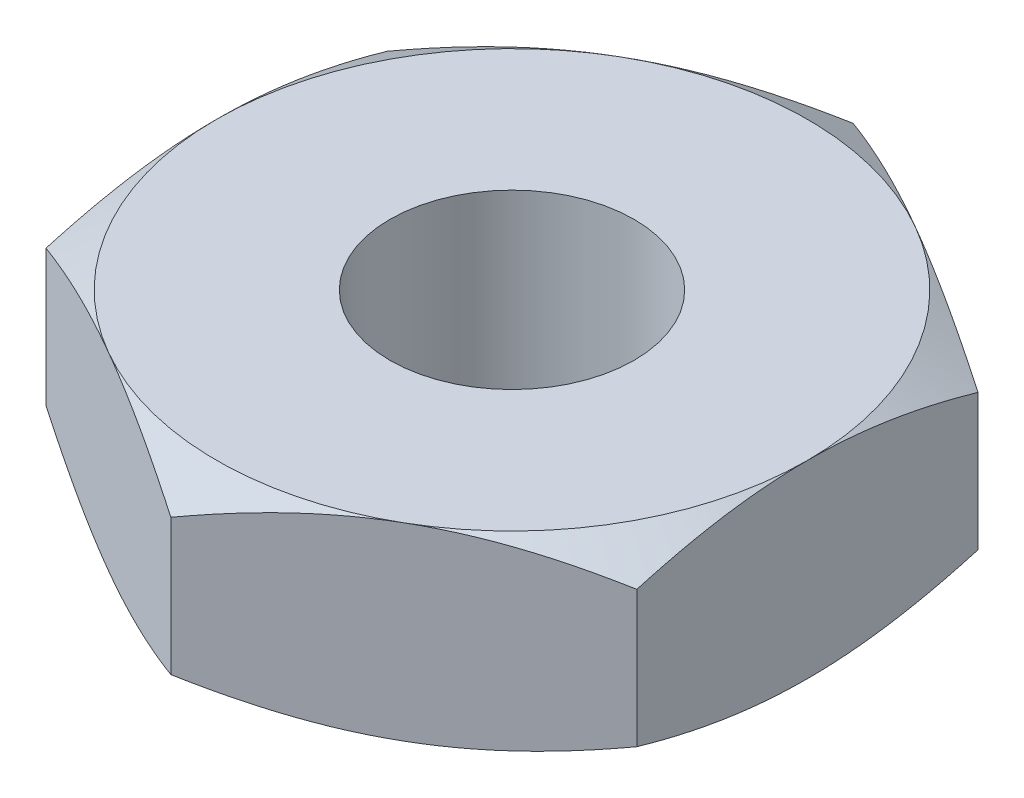
ISO-10303-21;
HEADER;
FILE_DESCRIPTION(('STEP AP214'),'2;1');
FILE_NAME('part.step','',(''),(''),'','','');
FILE_SCHEMA(('AUTOMOTIVE_DESIGN { 1 0 10303 214 1 1 1 1 }'));
ENDSEC;
DATA;
#1=APPLICATION_CONTEXT('core data for automotive mechanical design processes');
#2=APPLICATION_PROTOCOL_DEFINITION('international standard','automotive_design',2000,#1);
#3=PRODUCT_CONTEXT('',#1,'mechanical');
#4=PRODUCT('Part','Part','',(#3));
#5=PRODUCT_RELATED_PRODUCT_CATEGORY('part','',(#4));
#6=PRODUCT_DEFINITION_FORMATION('','',#4);
#7=PRODUCT_DEFINITION_CONTEXT('part definition',#1,'design');
#8=PRODUCT_DEFINITION('design','',#6,#7);
#9=PRODUCT_DEFINITION_SHAPE('','',#8);
#10=(LENGTH_UNIT() NAMED_UNIT(*) SI_UNIT(.MILLI.,.METRE.));
#11=(NAMED_UNIT(*) PLANE_ANGLE_UNIT() SI_UNIT($,.RADIAN.));
#12=(NAMED_UNIT(*) SI_UNIT($,.STERADIAN.) SOLID_ANGLE_UNIT());
#13=UNCERTAINTY_MEASURE_WITH_UNIT(LENGTH_MEASURE(1.E-05),#10,'distance_accuracy_value','');
#14=(GEOMETRIC_REPRESENTATION_CONTEXT(3) GLOBAL_UNCERTAINTY_ASSIGNED_CONTEXT((#13)) GLOBAL_UNIT_ASSIGNED_CONTEXT((#10,
#11,#12)) REPRESENTATION_CONTEXT('',''));
#15=CARTESIAN_POINT('',(0.,0.,0.));
#16=DIRECTION('',(0.,0.,1.));
#17=DIRECTION('',(1.,0.,0.));
#18=AXIS2_PLACEMENT_3D('',#15,#16,#17);
#19=CARTESIAN_POINT('',(2.5,1.6,-1.44337567297406));
#20=DIRECTION('',(-0.5,0.,0.866025403784439));
#21=DIRECTION('',(0.866025403784439,0.,0.5));
#22=AXIS2_PLACEMENT_3D('',#19,#20,#21);
#23=PLANE('',#22);
#24=DIRECTION('',(0.,-1.,0.));
#25=VECTOR('',#24,1.);
#26=CARTESIAN_POINT('',(2.5,1.6,-1.44337567297406));
#27=LINE('',#26,#25);
#28=CARTESIAN_POINT('',(2.5,1.3767090063074,-1.44337567297406));
#29=VERTEX_POINT('',#28);
#30=CARTESIAN_POINT('',(2.5,0.223290993692599,-1.44337567297406));
#31=VERTEX_POINT('',#30);
#32=EDGE_CURVE('E158',#29,#31,#27,.T.);
#33=ORIENTED_EDGE('',*,*,#32,.T.);
#34=CARTESIAN_POINT('',(2.5002,0.223357664359106,-1.44326020292023));
#35=CARTESIAN_POINT('',(2.39033676526513,0.186721620107623,-1.50668977106845));
#36=CARTESIAN_POINT('',(2.27952520010347,0.153402218965054,-1.57066685804385));
#37=CARTESIAN_POINT('',(2.05598316653395,0.0952422855578563,-1.69972891130041));
#38=CARTESIAN_POINT('',(1.94324872547161,0.0704223291477371,-1.7648161711947));
#39=CARTESIAN_POINT('',(1.71917700612473,0.0317856514410512,-1.8941840386774));
#40=CARTESIAN_POINT('',(1.60787420823262,0.0177117961856382,-1.95844473900197));
#41=CARTESIAN_POINT('',(1.38474477253167,0.00090915235274961,-2.08726857876804));
#42=CARTESIAN_POINT('',(1.27291894598577,-0.00183354879637404,-2.15183124982667));
#43=CARTESIAN_POINT('',(1.06395802444848,0.00386576000805273,-2.27247489412633));
#44=CARTESIAN_POINT('',(0.96679168244227,0.0109083943818608,-2.32857390783979));
#45=CARTESIAN_POINT('',(0.773092050288998,0.0332314191249413,-2.44040644260541));
#46=CARTESIAN_POINT('',(0.676559430340268,0.0485194384402656,-2.49613957671839));
#47=CARTESIAN_POINT('',(0.482460278259524,0.0867390938444183,-2.60820277442169));
#48=CARTESIAN_POINT('',(0.38491831821786,0.109832776125515,-2.66451865130903));
#49=CARTESIAN_POINT('',(0.191289391923915,0.162246656577911,-2.77631036402774));
#50=CARTESIAN_POINT('',(0.0951999441138243,0.191554535624546,-2.83178763258717));
#51=CARTESIAN_POINT('',(-0.000200000000000095,0.223357664359105,-2.88686681600197));
#52=B_SPLINE_CURVE_WITH_KNOTS('',3,(#34,#35,#36,#37,#38,#39,#40,#41,#42,#43,#44,#45,#46,#47,#48,
#49,#50,#51),.UNSPECIFIED.,.F.,.F.,(4,2,2,2,2,2,2,2,4),(0.,0.396285827362226,0.793524330152049,
1.18093086852114,1.56786160134475,1.90479741793733,2.24204551660463,2.58677531536756,
2.93082800105256),.UNSPECIFIED.);
#53=CARTESIAN_POINT('',(1.25,0.,-2.1650635094611));
#54=VERTEX_POINT('',#53);
#55=EDGE_CURVE('E64',#31,#54,#52,.T.);
#56=ORIENTED_EDGE('',*,*,#55,.T.);
#57=CARTESIAN_POINT('',(0.,0.223290993692599,-2.88675134594813));
#58=VERTEX_POINT('',#57);
#59=EDGE_CURVE('E131',#54,#58,#52,.T.);
#60=ORIENTED_EDGE('',*,*,#59,.T.);
#61=DIRECTION('',(0.,-1.,0.));
#62=VECTOR('',#61,1.);
#63=CARTESIAN_POINT('',(0.,1.6,-2.88675134594813));
#64=LINE('',#63,#62);
#65=CARTESIAN_POINT('',(0.,1.3767090063074,-2.88675134594813));
#66=VERTEX_POINT('',#65);
#67=EDGE_CURVE('E258',#66,#58,#64,.T.);
#68=ORIENTED_EDGE('',*,*,#67,.F.);
#69=CARTESIAN_POINT('',(-0.000200000000000084,1.37664233564089,-2.88686681600197));
#70=CARTESIAN_POINT('',(0.109663234734871,1.41327837989238,-2.82343724785374));
#71=CARTESIAN_POINT('',(0.220474799896525,1.44659778103495,-2.75946016087834));
#72=CARTESIAN_POINT('',(0.444016833466049,1.50475771444214,-2.63039810762178));
#73=CARTESIAN_POINT('',(0.556751274528388,1.52957767085226,-2.5653108477275));
#74=CARTESIAN_POINT('',(0.780822993875268,1.56821434855895,-2.43594298024479));
#75=CARTESIAN_POINT('',(0.892125791767376,1.58228820381436,-2.37168227992023));
#76=CARTESIAN_POINT('',(1.11525522746833,1.59909084764725,-2.24285844015415));
#77=CARTESIAN_POINT('',(1.22708105401423,1.60183354879637,-2.17829576909552));
#78=CARTESIAN_POINT('',(1.43604197555152,1.59613423999195,-2.05765212479586));
#79=CARTESIAN_POINT('',(1.53320831755773,1.58909160561814,-2.0015531110824));
#80=CARTESIAN_POINT('',(1.726907949711,1.56676858087506,-1.88972057631678));
#81=CARTESIAN_POINT('',(1.82344056965973,1.55148056155973,-1.8339874422038));
#82=CARTESIAN_POINT('',(2.01753972174048,1.51326090615558,-1.7219242445005));
#83=CARTESIAN_POINT('',(2.11508168178214,1.49016722387449,-1.66560836761316));
#84=CARTESIAN_POINT('',(2.30871060807608,1.43775334342209,-1.55381665489446));
#85=CARTESIAN_POINT('',(2.40480005588618,1.40844546437545,-1.49833938633502));
#86=CARTESIAN_POINT('',(2.5002,1.3766423356409,-1.44326020292023));
#87=B_SPLINE_CURVE_WITH_KNOTS('',3,(#69,#70,#71,#72,#73,#74,#75,#76,#77,#78,#79,#80,#81,#82,#83,
#84,#85,#86),.UNSPECIFIED.,.F.,.F.,(4,2,2,2,2,2,2,2,4),(0.,0.396285827362226,0.79352433015205,
1.18093086852114,1.56786160134475,1.90479741793733,2.24204551660463,2.58677531536756,
2.93082800105256),.UNSPECIFIED.);
#88=CARTESIAN_POINT('',(1.25,1.6,-2.1650635094611));
#89=VERTEX_POINT('',#88);
#90=EDGE_CURVE('E296',#66,#89,#87,.T.);
#91=ORIENTED_EDGE('',*,*,#90,.T.);
#92=EDGE_CURVE('E302',#89,#29,#87,.T.);
#93=ORIENTED_EDGE('',*,*,#92,.T.);
#94=EDGE_LOOP('',(#33,#56,#60,#68,#91,#93));
#95=FACE_BOUND('',#94,.T.);
#96=ADVANCED_FACE('F41',(#95),#23,.F.);
#97=CARTESIAN_POINT('',(0.,1.6,-2.88675134594813));
#98=DIRECTION('',(0.5,0.,0.866025403784439));
#99=DIRECTION('',(0.866025403784439,0.,-0.5));
#100=AXIS2_PLACEMENT_3D('',#97,#98,#99);
#101=PLANE('',#100);
#102=ORIENTED_EDGE('',*,*,#67,.T.);
#103=CARTESIAN_POINT('',(0.000199999999999964,0.223357664359105,-2.88686681600197));
#104=CARTESIAN_POINT('',(-0.109663234734871,0.186721620107623,-2.82343724785375));
#105=CARTESIAN_POINT('',(-0.220474799896526,0.153402218965054,-2.75946016087834));
#106=CARTESIAN_POINT('',(-0.444016833466049,0.0952422855578562,-2.63039810762178));
#107=CARTESIAN_POINT('',(-0.556751274528387,0.0704223291477371,-2.5653108477275));
#108=CARTESIAN_POINT('',(-0.780822993875268,0.0317856514410512,-2.43594298024479));
#109=CARTESIAN_POINT('',(-0.892125791767376,0.0177117961856381,-2.37168227992023));
#110=CARTESIAN_POINT('',(-1.11525522746833,0.000909152352749529,-2.24285844015415));
#111=CARTESIAN_POINT('',(-1.22708105401422,-0.00183354879637401,-2.17829576909553));
#112=CARTESIAN_POINT('',(-1.43604197555152,0.00386576000805285,-2.05765212479586));
#113=CARTESIAN_POINT('',(-1.53320831755773,0.0109083943818609,-2.0015531110824));
#114=CARTESIAN_POINT('',(-1.726907949711,0.0332314191249415,-1.88972057631678));
#115=CARTESIAN_POINT('',(-1.82344056965973,0.048519438440266,-1.8339874422038));
#116=CARTESIAN_POINT('',(-2.01753972174048,0.0867390938444188,-1.7219242445005));
#117=CARTESIAN_POINT('',(-2.11508168178214,0.109832776125515,-1.66560836761316));
#118=CARTESIAN_POINT('',(-2.30871060807609,0.162246656577911,-1.55381665489446));
#119=CARTESIAN_POINT('',(-2.40480005588618,0.191554535624546,-1.49833938633502));
#120=CARTESIAN_POINT('',(-2.5002,0.223357664359106,-1.44326020292023));
#121=B_SPLINE_CURVE_WITH_KNOTS('',3,(#103,#104,#105,#106,#107,#108,#109,#110,#111,#112,#113,
#114,#115,#116,#117,#118,#119,#120),.UNSPECIFIED.,.F.,.F.,(4,2,2,2,2,2,2,2,4),(0.,
0.396285827362226,0.793524330152049,1.18093086852114,1.56786160134475,1.90479741793733,
2.24204551660463,2.58677531536756,2.93082800105256),.UNSPECIFIED.);
#122=CARTESIAN_POINT('',(-1.25,0.,-2.1650635094611));
#123=VERTEX_POINT('',#122);
#124=EDGE_CURVE('E137',#58,#123,#121,.T.);
#125=ORIENTED_EDGE('',*,*,#124,.T.);
#126=CARTESIAN_POINT('',(-2.5,0.223290993692599,-1.44337567297406));
#127=VERTEX_POINT('',#126);
#128=EDGE_CURVE('E169',#123,#127,#121,.T.);
#129=ORIENTED_EDGE('',*,*,#128,.T.);
#130=DIRECTION('',(0.,-1.,0.));
#131=VECTOR('',#130,1.);
#132=CARTESIAN_POINT('',(-2.5,1.6,-1.44337567297406));
#133=LINE('',#132,#131);
#134=CARTESIAN_POINT('',(-2.5,1.3767090063074,-1.44337567297406));
#135=VERTEX_POINT('',#134);
#136=EDGE_CURVE('E255',#135,#127,#133,.T.);
#137=ORIENTED_EDGE('',*,*,#136,.F.);
#138=CARTESIAN_POINT('',(-2.5002,1.37664233564089,-1.44326020292023));
#139=CARTESIAN_POINT('',(-2.39033676526513,1.41327837989238,-1.50668977106845));
#140=CARTESIAN_POINT('',(-2.27952520010348,1.44659778103495,-1.57066685804385));
#141=CARTESIAN_POINT('',(-2.05598316653395,1.50475771444214,-1.69972891130041));
#142=CARTESIAN_POINT('',(-1.94324872547161,1.52957767085226,-1.7648161711947));
#143=CARTESIAN_POINT('',(-1.71917700612473,1.56821434855895,-1.8941840386774));
#144=CARTESIAN_POINT('',(-1.60787420823262,1.58228820381436,-1.95844473900197));
#145=CARTESIAN_POINT('',(-1.38474477253167,1.59909084764725,-2.08726857876804));
#146=CARTESIAN_POINT('',(-1.27291894598578,1.60183354879637,-2.15183124982667));
#147=CARTESIAN_POINT('',(-1.06395802444848,1.59613423999195,-2.27247489412633));
#148=CARTESIAN_POINT('',(-0.966791682442271,1.58909160561814,-2.32857390783979));
#149=CARTESIAN_POINT('',(-0.773092050288999,1.56676858087506,-2.44040644260541));
#150=CARTESIAN_POINT('',(-0.676559430340269,1.55148056155973,-2.49613957671839));
#151=CARTESIAN_POINT('',(-0.482460278259525,1.51326090615558,-2.60820277442169));
#152=CARTESIAN_POINT('',(-0.38491831821786,1.49016722387449,-2.66451865130903));
#153=CARTESIAN_POINT('',(-0.191289391923915,1.43775334342209,-2.77631036402774));
#154=CARTESIAN_POINT('',(-0.0951999441138242,1.40844546437545,-2.83178763258717));
#155=CARTESIAN_POINT('',(0.000200000000000055,1.37664233564089,-2.88686681600197));
#156=B_SPLINE_CURVE_WITH_KNOTS('',3,(#138,#139,#140,#141,#142,#143,#144,#145,#146,#147,#148,
#149,#150,#151,#152,#153,#154,#155),.UNSPECIFIED.,.F.,.F.,(4,2,2,2,2,2,2,2,4),(0.,
0.396285827362226,0.793524330152049,1.18093086852114,1.56786160134475,1.90479741793733,
2.24204551660463,2.58677531536756,2.93082800105256),.UNSPECIFIED.);
#157=CARTESIAN_POINT('',(-1.25,1.6,-2.1650635094611));
#158=VERTEX_POINT('',#157);
#159=EDGE_CURVE('E351',#135,#158,#156,.T.);
#160=ORIENTED_EDGE('',*,*,#159,.T.);
#161=EDGE_CURVE('E239',#158,#66,#156,.T.);
#162=ORIENTED_EDGE('',*,*,#161,.T.);
#163=EDGE_LOOP('',(#102,#125,#129,#137,#160,#162));
#164=FACE_BOUND('',#163,.T.);
#165=ADVANCED_FACE('F223',(#164),#101,.F.);
#166=CARTESIAN_POINT('',(-2.5,1.6,-1.44337567297406));
#167=DIRECTION('',(1.,0.,0.));
#168=DIRECTION('',(0.,0.,-1.));
#169=AXIS2_PLACEMENT_3D('',#166,#167,#168);
#170=PLANE('',#169);
#171=ORIENTED_EDGE('',*,*,#136,.T.);
#172=CARTESIAN_POINT('',(-2.5,1.19631676327538,-3.82804499372432));
#173=CARTESIAN_POINT('',(-2.5,1.14327266922929,-3.71828085649172));
#174=CARTESIAN_POINT('',(-2.5,1.09075587737961,-3.60825720059553));
#175=CARTESIAN_POINT('',(-2.5,0.987078216748211,-3.38755052986221));
#176=CARTESIAN_POINT('',(-2.5,0.935917582729504,-3.27686740487454));
#177=CARTESIAN_POINT('',(-2.5,0.834984039411584,-3.05410357303958));
#178=CARTESIAN_POINT('',(-2.5,0.785220746914385,-2.94201849305851));
#179=CARTESIAN_POINT('',(-2.5,0.687831615887674,-2.71692709217039));
#180=CARTESIAN_POINT('',(-2.5,0.640205665942501,-2.6039208196471));
#181=CARTESIAN_POINT('',(-2.5,0.547094156496466,-2.3754044171561));
#182=CARTESIAN_POINT('',(-2.5,0.501642052634894,-2.25988058014231));
#183=CARTESIAN_POINT('',(-2.5,0.41429764434963,-2.02747029246855));
#184=CARTESIAN_POINT('',(-2.5,0.372405735979058,-1.91058369184875));
#185=CARTESIAN_POINT('',(-2.5,0.293307342769295,-1.67550198908606));
#186=CARTESIAN_POINT('',(-2.5,0.256090896739893,-1.5573102732053));
#187=CARTESIAN_POINT('',(-2.5,0.187552097840313,-1.31924659147407));
#188=CARTESIAN_POINT('',(-2.5,0.156227881047967,-1.19937516991093));
#189=CARTESIAN_POINT('',(-2.5,0.100994246846274,-0.957870204363746));
#190=CARTESIAN_POINT('',(-2.5,0.0770868037228361,-0.836236200197807));
#191=CARTESIAN_POINT('',(-2.5,0.038296397451464,-0.591501703670344));
#192=CARTESIAN_POINT('',(-2.5,0.0234134422823116,-0.468401210012356));
#193=CARTESIAN_POINT('',(-2.5,0.00398863321839781,-0.222157493517462));
#194=CARTESIAN_POINT('',(-2.5,-0.000618687975650645,-0.0990195694337553));
#195=CARTESIAN_POINT('',(-2.5,0.00075254148424759,0.147170053504669));
#196=CARTESIAN_POINT('',(-2.5,0.00672834425959459,0.270221766445129));
#197=CARTESIAN_POINT('',(-2.5,0.0255492091334945,0.48035039701595));
#198=CARTESIAN_POINT('',(-2.5,0.035943310027444,0.567659136488641));
#199=CARTESIAN_POINT('',(-2.5,0.061383381466683,0.741602181646865));
#200=CARTESIAN_POINT('',(-2.5,0.0764300856615298,0.828236378756341));
#201=CARTESIAN_POINT('',(-2.5,0.127759419343896,1.08705653408107));
#202=CARTESIAN_POINT('',(-2.5,0.170218054015723,1.25802931580453));
#203=CARTESIAN_POINT('',(-2.5,0.243447724573256,1.5138640813408));
#204=CARTESIAN_POINT('',(-2.5,0.269821213632277,1.60005960225964));
#205=CARTESIAN_POINT('',(-2.5,0.325177862642356,1.7715509943838));
#206=CARTESIAN_POINT('',(-2.5,0.354159222616826,1.85684744139726));
#207=CARTESIAN_POINT('',(-2.5,0.414128561987685,2.02618400322716));
#208=CARTESIAN_POINT('',(-2.5,0.445104328595944,2.11022848716777));
#209=CARTESIAN_POINT('',(-2.5,0.508873971119196,2.27766538220575));
#210=CARTESIAN_POINT('',(-2.5,0.541668581852114,2.36105751399621));
#211=CARTESIAN_POINT('',(-2.5,0.575193129088629,2.44414811866682));
#212=B_SPLINE_CURVE_WITH_KNOTS('',3,(#172,#173,#174,#175,#176,#177,#178,#179,#180,#181,#182,
#183,#184,#185,#186,#187,#188,#189,#190,#191,#192,#193,#194,#195,#196,#197,#198,#199,#200,#201,
#202,#203,#204,#205,#206,#207,#208,#209,#210,#211),.UNSPECIFIED.,.F.,.F.,(4,2,2,2,2,2,2,2,2,2,2,
2,2,2,2,2,2,2,2,4),(0.,0.365732370332669,0.731527644124541,1.09941621653743,1.46728558928017,
1.83967125623427,2.2120982950668,2.58371790436,2.95521975869669,3.32682041917402,
3.69842140819257,4.06764803658772,4.43677881037428,4.7004258801595,4.96411454456775,
5.49188432099895,5.76228301186057,6.03249648197688,6.30118900914359,6.56999089095296),.UNSPECIFIED.);
#213=CARTESIAN_POINT('',(-2.5,0.,0.));
#214=VERTEX_POINT('',#213);
#215=EDGE_CURVE('E217',#127,#214,#212,.T.);
#216=ORIENTED_EDGE('',*,*,#215,.T.);
#217=CARTESIAN_POINT('',(-2.5,0.223290993692599,1.44337567297407));
#218=VERTEX_POINT('',#217);
#219=EDGE_CURVE('E210',#214,#218,#212,.T.);
#220=ORIENTED_EDGE('',*,*,#219,.T.);
#221=DIRECTION('',(0.,-1.,0.));
#222=VECTOR('',#221,1.);
#223=CARTESIAN_POINT('',(-2.5,1.6,1.44337567297407));
#224=LINE('',#223,#222);
#225=CARTESIAN_POINT('',(-2.5,1.3767090063074,1.44337567297407));
#226=VERTEX_POINT('',#225);
#227=EDGE_CURVE('E252',#226,#218,#224,.T.);
#228=ORIENTED_EDGE('',*,*,#227,.F.);
#229=CARTESIAN_POINT('',(-2.5,0.40368323672462,-3.82804499372432));
#230=CARTESIAN_POINT('',(-2.5,0.456727330770707,-3.71828085649172));
#231=CARTESIAN_POINT('',(-2.5,0.509244122620395,-3.60825720059553));
#232=CARTESIAN_POINT('',(-2.5,0.61292178325179,-3.38755052986221));
#233=CARTESIAN_POINT('',(-2.5,0.664082417270497,-3.27686740487454));
#234=CARTESIAN_POINT('',(-2.5,0.765015960588417,-3.05410357303958));
#235=CARTESIAN_POINT('',(-2.5,0.814779253085615,-2.94201849305851));
#236=CARTESIAN_POINT('',(-2.5,0.912168384112327,-2.71692709217039));
#237=CARTESIAN_POINT('',(-2.5,0.959794334057499,-2.6039208196471));
#238=CARTESIAN_POINT('',(-2.5,1.05290584350353,-2.3754044171561));
#239=CARTESIAN_POINT('',(-2.5,1.09835794736511,-2.25988058014231));
#240=CARTESIAN_POINT('',(-2.5,1.18570235565037,-2.02747029246855));
#241=CARTESIAN_POINT('',(-2.5,1.22759426402094,-1.91058369184875));
#242=CARTESIAN_POINT('',(-2.5,1.30669265723071,-1.67550198908606));
#243=CARTESIAN_POINT('',(-2.5,1.34390910326011,-1.5573102732053));
#244=CARTESIAN_POINT('',(-2.5,1.41244790215969,-1.31924659147407));
#245=CARTESIAN_POINT('',(-2.5,1.44377211895203,-1.19937516991093));
#246=CARTESIAN_POINT('',(-2.5,1.49900575315373,-0.957870204363746));
#247=CARTESIAN_POINT('',(-2.5,1.52291319627716,-0.836236200197807));
#248=CARTESIAN_POINT('',(-2.5,1.56170360254854,-0.591501703670343));
#249=CARTESIAN_POINT('',(-2.5,1.57658655771769,-0.468401210012356));
#250=CARTESIAN_POINT('',(-2.5,1.5960113667816,-0.222157493517463));
#251=CARTESIAN_POINT('',(-2.5,1.60061868797565,-0.0990195694337558));
#252=CARTESIAN_POINT('',(-2.5,1.59924745851575,0.147170053504669));
#253=CARTESIAN_POINT('',(-2.5,1.59327165574041,0.270221766445129));
#254=CARTESIAN_POINT('',(-2.5,1.57445079086651,0.48035039701595));
#255=CARTESIAN_POINT('',(-2.5,1.56405668997256,0.567659136488641));
#256=CARTESIAN_POINT('',(-2.5,1.53861661853332,0.741602181646865));
#257=CARTESIAN_POINT('',(-2.5,1.52356991433847,0.828236378756341));
#258=CARTESIAN_POINT('',(-2.5,1.47224058065611,1.08705653408107));
#259=CARTESIAN_POINT('',(-2.5,1.42978194598428,1.25802931580453));
#260=CARTESIAN_POINT('',(-2.5,1.35655227542675,1.5138640813408));
#261=CARTESIAN_POINT('',(-2.5,1.33017878636773,1.60005960225964));
#262=CARTESIAN_POINT('',(-2.5,1.27482213735765,1.7715509943838));
#263=CARTESIAN_POINT('',(-2.5,1.24584077738318,1.85684744139726));
#264=CARTESIAN_POINT('',(-2.5,1.18587143801232,2.02618400322716));
#265=CARTESIAN_POINT('',(-2.5,1.15489567140406,2.11022848716777));
#266=CARTESIAN_POINT('',(-2.5,1.0911260288808,2.27766538220575));
#267=CARTESIAN_POINT('',(-2.5,1.05833141814789,2.36105751399621));
#268=CARTESIAN_POINT('',(-2.5,1.02480687091137,2.44414811866682));
#269=B_SPLINE_CURVE_WITH_KNOTS('',3,(#229,#230,#231,#232,#233,#234,#235,#236,#237,#238,#239,
#240,#241,#242,#243,#244,#245,#246,#247,#248,#249,#250,#251,#252,#253,#254,#255,#256,#257,#258,
#259,#260,#261,#262,#263,#264,#265,#266,#267,#268),.UNSPECIFIED.,.F.,.F.,(4,2,2,2,2,2,2,2,2,2,2,
2,2,2,2,2,2,2,2,4),(0.,0.365732370332669,0.731527644124542,1.09941621653743,1.46728558928017,
1.83967125623427,2.2120982950668,2.58371790436,2.95521975869669,3.32682041917403,
3.69842140819257,4.06764803658772,4.43677881037428,4.7004258801595,4.96411454456775,
5.49188432099895,5.76228301186058,6.03249648197688,6.30118900914359,6.56999089095297),.UNSPECIFIED.);
#270=CARTESIAN_POINT('',(-2.5,1.6,0.));
#271=VERTEX_POINT('',#270);
#272=EDGE_CURVE('E237',#226,#271,#269,.F.);
#273=ORIENTED_EDGE('',*,*,#272,.T.);
#274=EDGE_CURVE('E229',#271,#135,#269,.F.);
#275=ORIENTED_EDGE('',*,*,#274,.T.);
#276=EDGE_LOOP('',(#171,#216,#220,#228,#273,#275));
#277=FACE_BOUND('',#276,.T.);
#278=ADVANCED_FACE('F219',(#277),#170,.F.);
#279=CARTESIAN_POINT('',(-2.5,1.6,1.44337567297407));
#280=DIRECTION('',(0.5,0.,-0.866025403784439));
#281=DIRECTION('',(-0.866025403784439,0.,-0.5));
#282=AXIS2_PLACEMENT_3D('',#279,#280,#281);
#283=PLANE('',#282);
#284=ORIENTED_EDGE('',*,*,#227,.T.);
#285=CARTESIAN_POINT('',(-2.5002,0.223357664359107,1.44326020292023));
#286=CARTESIAN_POINT('',(-2.39033676526513,0.186721620107625,1.50668977106845));
#287=CARTESIAN_POINT('',(-2.27952520010348,0.153402218965055,1.57066685804385));
#288=CARTESIAN_POINT('',(-2.05598316653395,0.0952422855578577,1.69972891130042));
#289=CARTESIAN_POINT('',(-1.94324872547161,0.0704223291477385,1.7648161711947));
#290=CARTESIAN_POINT('',(-1.71917700612473,0.0317856514410528,1.8941840386774));
#291=CARTESIAN_POINT('',(-1.60787420823262,0.0177117961856399,1.95844473900197));
#292=CARTESIAN_POINT('',(-1.38474477253167,0.000909152352751357,2.08726857876805));
#293=CARTESIAN_POINT('',(-1.27291894598577,-0.00183354879637227,2.15183124982667));
#294=CARTESIAN_POINT('',(-1.06395802444848,0.00386576000805451,2.27247489412634));
#295=CARTESIAN_POINT('',(-0.96679168244227,0.0109083943818626,2.3285739078398));
#296=CARTESIAN_POINT('',(-0.773092050288999,0.0332314191249431,2.44040644260542));
#297=CARTESIAN_POINT('',(-0.676559430340269,0.0485194384402675,2.4961395767184));
#298=CARTESIAN_POINT('',(-0.482460278259525,0.0867390938444204,2.60820277442169));
#299=CARTESIAN_POINT('',(-0.38491831821786,0.109832776125517,2.66451865130903));
#300=CARTESIAN_POINT('',(-0.191289391923915,0.162246656577913,2.77631036402774));
#301=CARTESIAN_POINT('',(-0.0951999441138244,0.191554535624548,2.83178763258718));
#302=CARTESIAN_POINT('',(0.000199999999999589,0.223357664359107,2.88686681600197));
#303=B_SPLINE_CURVE_WITH_KNOTS('',3,(#285,#286,#287,#288,#289,#290,#291,#292,#293,#294,#295,
#296,#297,#298,#299,#300,#301,#302),.UNSPECIFIED.,.F.,.F.,(4,2,2,2,2,2,2,2,4),(0.,
0.396285827362226,0.79352433015205,1.18093086852114,1.56786160134475,1.90479741793733,
2.24204551660463,2.58677531536756,2.93082800105256),.UNSPECIFIED.);
#304=CARTESIAN_POINT('',(-1.25,0.,2.1650635094611));
#305=VERTEX_POINT('',#304);
#306=EDGE_CURVE('E218',#218,#305,#303,.T.);
#307=ORIENTED_EDGE('',*,*,#306,.T.);
#308=CARTESIAN_POINT('',(0.,0.223290993692599,2.88675134594813));
#309=VERTEX_POINT('',#308);
#310=EDGE_CURVE('E204',#305,#309,#303,.T.);
#311=ORIENTED_EDGE('',*,*,#310,.T.);
#312=DIRECTION('',(0.,-1.,0.));
#313=VECTOR('',#312,1.);
#314=CARTESIAN_POINT('',(0.,1.6,2.88675134594813));
#315=LINE('',#314,#313);
#316=CARTESIAN_POINT('',(0.,1.3767090063074,2.88675134594813));
#317=VERTEX_POINT('',#316);
#318=EDGE_CURVE('E249',#317,#309,#315,.T.);
#319=ORIENTED_EDGE('',*,*,#318,.F.);
#320=CARTESIAN_POINT('',(0.000199999999999657,1.37664233564089,2.88686681600197));
#321=CARTESIAN_POINT('',(-0.109663234734871,1.41327837989238,2.82343724785375));
#322=CARTESIAN_POINT('',(-0.220474799896526,1.44659778103495,2.75946016087834));
#323=CARTESIAN_POINT('',(-0.444016833466049,1.50475771444214,2.63039810762178));
#324=CARTESIAN_POINT('',(-0.556751274528388,1.52957767085226,2.5653108477275));
#325=CARTESIAN_POINT('',(-0.780822993875268,1.56821434855895,2.4359429802448));
#326=CARTESIAN_POINT('',(-0.892125791767376,1.58228820381436,2.37168227992023));
#327=CARTESIAN_POINT('',(-1.11525522746833,1.59909084764725,2.24285844015415));
#328=CARTESIAN_POINT('',(-1.22708105401423,1.60183354879637,2.17829576909553));
#329=CARTESIAN_POINT('',(-1.43604197555152,1.59613423999195,2.05765212479586));
#330=CARTESIAN_POINT('',(-1.53320831755773,1.58909160561814,2.0015531110824));
#331=CARTESIAN_POINT('',(-1.726907949711,1.56676858087506,1.88972057631678));
#332=CARTESIAN_POINT('',(-1.82344056965973,1.55148056155973,1.8339874422038));
#333=CARTESIAN_POINT('',(-2.01753972174048,1.51326090615558,1.7219242445005));
#334=CARTESIAN_POINT('',(-2.11508168178214,1.49016722387448,1.66560836761317));
#335=CARTESIAN_POINT('',(-2.30871060807609,1.43775334342209,1.55381665489446));
#336=CARTESIAN_POINT('',(-2.40480005588618,1.40844546437545,1.49833938633502));
#337=CARTESIAN_POINT('',(-2.5002,1.37664233564089,1.44326020292023));
#338=B_SPLINE_CURVE_WITH_KNOTS('',3,(#320,#321,#322,#323,#324,#325,#326,#327,#328,#329,#330,
#331,#332,#333,#334,#335,#336,#337),.UNSPECIFIED.,.F.,.F.,(4,2,2,2,2,2,2,2,4),(0.,
0.396285827362226,0.793524330152049,1.18093086852114,1.56786160134475,1.90479741793733,
2.24204551660463,2.58677531536756,2.93082800105256),.UNSPECIFIED.);
#339=CARTESIAN_POINT('',(-1.25,1.6,2.1650635094611));
#340=VERTEX_POINT('',#339);
#341=EDGE_CURVE('E293',#317,#340,#338,.T.);
#342=ORIENTED_EDGE('',*,*,#341,.T.);
#343=EDGE_CURVE('E238',#340,#226,#338,.T.);
#344=ORIENTED_EDGE('',*,*,#343,.T.);
#345=EDGE_LOOP('',(#284,#307,#311,#319,#342,#344));
#346=FACE_BOUND('',#345,.T.);
#347=ADVANCED_FACE('F222',(#346),#283,.F.);
#348=CARTESIAN_POINT('',(0.,1.6,2.88675134594813));
#349=DIRECTION('',(-0.5,0.,-0.866025403784439));
#350=DIRECTION('',(-0.866025403784439,0.,0.5));
#351=AXIS2_PLACEMENT_3D('',#348,#349,#350);
#352=PLANE('',#351);
#353=ORIENTED_EDGE('',*,*,#318,.T.);
#354=CARTESIAN_POINT('',(-0.000200000000000392,0.223357664359107,2.88686681600197));
#355=CARTESIAN_POINT('',(0.109663234734871,0.186721620107625,2.82343724785375));
#356=CARTESIAN_POINT('',(0.220474799896525,0.153402218965056,2.75946016087834));
#357=CARTESIAN_POINT('',(0.44401683346605,0.0952422855578581,2.63039810762178));
#358=CARTESIAN_POINT('',(0.556751274528388,0.070422329147739,2.5653108477275));
#359=CARTESIAN_POINT('',(0.780822993875268,0.031785651441053,2.4359429802448));
#360=CARTESIAN_POINT('',(0.892125791767377,0.0177117961856399,2.37168227992023));
#361=CARTESIAN_POINT('',(1.11525522746833,0.00090915235275127,2.24285844015415));
#362=CARTESIAN_POINT('',(1.22708105401423,-0.0018335487963723,2.17829576909553));
#363=CARTESIAN_POINT('',(1.43604197555152,0.00386576000805451,2.05765212479586));
#364=CARTESIAN_POINT('',(1.53320831755773,0.0109083943818625,2.0015531110824));
#365=CARTESIAN_POINT('',(1.726907949711,0.0332314191249431,1.88972057631678));
#366=CARTESIAN_POINT('',(1.82344056965973,0.0485194384402676,1.8339874422038));
#367=CARTESIAN_POINT('',(2.01753972174048,0.0867390938444203,1.72192424450051));
#368=CARTESIAN_POINT('',(2.11508168178214,0.109832776125517,1.66560836761317));
#369=CARTESIAN_POINT('',(2.30871060807608,0.162246656577912,1.55381665489446));
#370=CARTESIAN_POINT('',(2.40480005588618,0.191554535624547,1.49833938633502));
#371=CARTESIAN_POINT('',(2.5002,0.223357664359106,1.44326020292023));
#372=B_SPLINE_CURVE_WITH_KNOTS('',3,(#354,#355,#356,#357,#358,#359,#360,#361,#362,#363,#364,
#365,#366,#367,#368,#369,#370,#371),.UNSPECIFIED.,.F.,.F.,(4,2,2,2,2,2,2,2,4),(0.,
0.396285827362227,0.793524330152051,1.18093086852114,1.56786160134475,1.90479741793733,
2.24204551660463,2.58677531536756,2.93082800105256),.UNSPECIFIED.);
#373=CARTESIAN_POINT('',(1.25,0.,2.1650635094611));
#374=VERTEX_POINT('',#373);
#375=EDGE_CURVE('E549',#309,#374,#372,.T.);
#376=ORIENTED_EDGE('',*,*,#375,.T.);
#377=CARTESIAN_POINT('',(2.5,0.223290993692599,1.44337567297406));
#378=VERTEX_POINT('',#377);
#379=EDGE_CURVE('E196',#374,#378,#372,.T.);
#380=ORIENTED_EDGE('',*,*,#379,.T.);
#381=DIRECTION('',(0.,-1.,0.));
#382=VECTOR('',#381,1.);
#383=CARTESIAN_POINT('',(2.5,1.6,1.44337567297407));
#384=LINE('',#383,#382);
#385=CARTESIAN_POINT('',(2.5,1.3767090063074,1.44337567297407));
#386=VERTEX_POINT('',#385);
#387=EDGE_CURVE('E246',#386,#378,#384,.T.);
#388=ORIENTED_EDGE('',*,*,#387,.F.);
#389=CARTESIAN_POINT('',(2.5002,1.3766423356409,1.44326020292023));
#390=CARTESIAN_POINT('',(2.39033676526513,1.41327837989238,1.50668977106845));
#391=CARTESIAN_POINT('',(2.27952520010347,1.44659778103495,1.57066685804386));
#392=CARTESIAN_POINT('',(2.05598316653395,1.50475771444214,1.69972891130042));
#393=CARTESIAN_POINT('',(1.94324872547161,1.52957767085226,1.7648161711947));
#394=CARTESIAN_POINT('',(1.71917700612473,1.56821434855895,1.8941840386774));
#395=CARTESIAN_POINT('',(1.60787420823262,1.58228820381436,1.95844473900197));
#396=CARTESIAN_POINT('',(1.38474477253167,1.59909084764725,2.08726857876805));
#397=CARTESIAN_POINT('',(1.27291894598577,1.60183354879637,2.15183124982667));
#398=CARTESIAN_POINT('',(1.06395802444848,1.59613423999195,2.27247489412634));
#399=CARTESIAN_POINT('',(0.966791682442269,1.58909160561814,2.3285739078398));
#400=CARTESIAN_POINT('',(0.773092050288997,1.56676858087506,2.44040644260542));
#401=CARTESIAN_POINT('',(0.676559430340268,1.55148056155973,2.4961395767184));
#402=CARTESIAN_POINT('',(0.482460278259524,1.51326090615558,2.60820277442169));
#403=CARTESIAN_POINT('',(0.384918318217859,1.49016722387448,2.66451865130903));
#404=CARTESIAN_POINT('',(0.191289391923915,1.43775334342209,2.77631036402774));
#405=CARTESIAN_POINT('',(0.0951999441138236,1.40844546437545,2.83178763258718));
#406=CARTESIAN_POINT('',(-0.000200000000000461,1.37664233564089,2.88686681600197));
#407=B_SPLINE_CURVE_WITH_KNOTS('',3,(#389,#390,#391,#392,#393,#394,#395,#396,#397,#398,#399,
#400,#401,#402,#403,#404,#405,#406),.UNSPECIFIED.,.F.,.F.,(4,2,2,2,2,2,2,2,4),(0.,
0.396285827362226,0.793524330152049,1.18093086852114,1.56786160134475,1.90479741793733,
2.24204551660463,2.58677531536756,2.93082800105256),.UNSPECIFIED.);
#408=CARTESIAN_POINT('',(1.25,1.6,2.1650635094611));
#409=VERTEX_POINT('',#408);
#410=EDGE_CURVE('E283',#386,#409,#407,.T.);
#411=ORIENTED_EDGE('',*,*,#410,.T.);
#412=EDGE_CURVE('E290',#409,#317,#407,.T.);
#413=ORIENTED_EDGE('',*,*,#412,.T.);
#414=EDGE_LOOP('',(#353,#376,#380,#388,#411,#413));
#415=FACE_BOUND('',#414,.T.);
#416=ADVANCED_FACE('F300',(#415),#352,.F.);
#417=CARTESIAN_POINT('',(2.5,1.6,1.44337567297407));
#418=DIRECTION('',(-1.,0.,0.));
#419=DIRECTION('',(0.,0.,1.));
#420=AXIS2_PLACEMENT_3D('',#417,#418,#419);
#421=PLANE('',#420);
#422=ORIENTED_EDGE('',*,*,#387,.T.);
#423=CARTESIAN_POINT('',(2.5,1.19631719462706,-3.82804588606158));
#424=CARTESIAN_POINT('',(2.5,1.1432730821246,-3.71828171828268));
#425=CARTESIAN_POINT('',(2.5,1.0907562718294,-3.60825803181684));
#426=CARTESIAN_POINT('',(2.5,0.98707857440522,-3.38755129984201));
#427=CARTESIAN_POINT('',(2.5,0.935917922039251,-3.27686814418247));
#428=CARTESIAN_POINT('',(2.5,0.834984342017556,-3.05410425049089));
#429=CARTESIAN_POINT('',(2.5,0.785221031167754,-2.94201913932292));
#430=CARTESIAN_POINT('',(2.5,0.687831863773547,-2.71692767582903));
#431=CARTESIAN_POINT('',(2.5,0.640205895813446,-2.60392137188689));
#432=CARTESIAN_POINT('',(2.5,0.547094350647382,-2.37540490571202));
#433=CARTESIAN_POINT('',(2.5,0.501642229090351,-2.25988103642781));
#434=CARTESIAN_POINT('',(2.5,0.414297786395571,-2.02747068367306));
#435=CARTESIAN_POINT('',(2.5,0.37240586131129,-1.91058405024255));
#436=CARTESIAN_POINT('',(2.5,0.293307436338151,-1.67550228123859));
#437=CARTESIAN_POINT('',(2.5,0.256090975253657,-1.55731053192955));
#438=CARTESIAN_POINT('',(2.5,0.187552148791344,-1.31924678242158));
#439=CARTESIAN_POINT('',(2.5,0.156227919489701,-1.19937532651053));
#440=CARTESIAN_POINT('',(2.5,0.100994259980165,-0.957870273262472));
#441=CARTESIAN_POINT('',(2.5,0.0770868051605593,-0.836236215486561));
#442=CARTESIAN_POINT('',(2.5,0.0382963836731119,-0.591501610534911));
#443=CARTESIAN_POINT('',(2.5,0.0234134249781849,-0.468401062063661));
#444=CARTESIAN_POINT('',(2.5,0.00398861851142493,-0.222157236207171));
#445=CARTESIAN_POINT('',(2.5,-0.000618696640384166,-0.0990192575787297));
#446=CARTESIAN_POINT('',(2.5,0.000752554217982313,0.147170473520897));
#447=CARTESIAN_POINT('',(2.5,0.00672837235162745,0.270222240078054));
#448=CARTESIAN_POINT('',(2.5,0.0255492679731271,0.480350939206175));
#449=CARTESIAN_POINT('',(2.5,0.0359433811737783,0.567659694215583));
#450=CARTESIAN_POINT('',(2.5,0.0613834779042065,0.741602769794547));
#451=CARTESIAN_POINT('',(2.5,0.0764301950836542,0.828236981787943));
#452=CARTESIAN_POINT('',(2.5,0.127759568035471,1.08705718104797));
#453=CARTESIAN_POINT('',(2.5,0.170218229281861,1.25802999101341));
#454=CARTESIAN_POINT('',(2.5,0.243447939149863,1.5138647987597));
#455=CARTESIAN_POINT('',(2.5,0.269821441407084,1.60006033398196));
#456=CARTESIAN_POINT('',(2.5,0.325178116432773,1.77155175455055));
#457=CARTESIAN_POINT('',(2.5,0.354159489224477,1.85684821570526));
#458=CARTESIAN_POINT('',(2.5,0.414128853727964,2.02618480561257));
#459=CARTESIAN_POINT('',(2.5,0.445104632651976,2.11022930349031));
#460=CARTESIAN_POINT('',(2.5,0.5088742994358,2.277666226433));
#461=CARTESIAN_POINT('',(2.5,0.541668922113928,2.36105837219083));
#462=CARTESIAN_POINT('',(2.5,0.575193481112136,2.44414899085243));
#463=B_SPLINE_CURVE_WITH_KNOTS('',3,(#423,#424,#425,#426,#427,#428,#429,#430,#431,#432,#433,
#434,#435,#436,#437,#438,#439,#440,#441,#442,#443,#444,#445,#446,#447,#448,#449,#450,#451,#452,
#453,#454,#455,#456,#457,#458,#459,#460,#461,#462),.UNSPECIFIED.,.F.,.F.,(4,2,2,2,2,2,2,2,2,2,2,
2,2,2,2,2,2,2,2,4),(0.,0.365732476934656,0.731527857346201,1.09941653761222,1.46728601819944,
1.83967179466915,2.2120989430543,2.58371866150581,2.95522062491227,3.32682144960045,
3.69842260258811,4.06764939320246,4.43678032932268,4.70042744974499,4.9641161647987,
5.49188604280506,5.76228478630216,6.03249830897404,6.30119088816195,6.56999282209528),.UNSPECIFIED.);
#464=CARTESIAN_POINT('',(2.5,0.,0.));
#465=VERTEX_POINT('',#464);
#466=EDGE_CURVE('E547',#378,#465,#463,.F.);
#467=ORIENTED_EDGE('',*,*,#466,.T.);
#468=EDGE_CURVE('E145',#465,#31,#463,.F.);
#469=ORIENTED_EDGE('',*,*,#468,.T.);
#470=ORIENTED_EDGE('',*,*,#32,.F.);
#471=CARTESIAN_POINT('',(2.5,0.403682805372939,-3.82804588606158));
#472=CARTESIAN_POINT('',(2.5,0.456726917875396,-3.71828171828268));
#473=CARTESIAN_POINT('',(2.5,0.509243728170597,-3.60825803181684));
#474=CARTESIAN_POINT('',(2.5,0.612921425594781,-3.38755129984201));
#475=CARTESIAN_POINT('',(2.5,0.66408207796075,-3.27686814418247));
#476=CARTESIAN_POINT('',(2.5,0.765015657982445,-3.05410425049089));
#477=CARTESIAN_POINT('',(2.5,0.814778968832246,-2.94201913932292));
#478=CARTESIAN_POINT('',(2.5,0.912168136226454,-2.71692767582903));
#479=CARTESIAN_POINT('',(2.5,0.959794104186555,-2.60392137188689));
#480=CARTESIAN_POINT('',(2.5,1.05290564935262,-2.37540490571202));
#481=CARTESIAN_POINT('',(2.5,1.09835777090965,-2.25988103642781));
#482=CARTESIAN_POINT('',(2.5,1.18570221360443,-2.02747068367306));
#483=CARTESIAN_POINT('',(2.5,1.22759413868871,-1.91058405024255));
#484=CARTESIAN_POINT('',(2.5,1.30669256366185,-1.67550228123859));
#485=CARTESIAN_POINT('',(2.5,1.34390902474634,-1.55731053192955));
#486=CARTESIAN_POINT('',(2.5,1.41244785120866,-1.31924678242158));
#487=CARTESIAN_POINT('',(2.5,1.4437720805103,-1.19937532651053));
#488=CARTESIAN_POINT('',(2.5,1.49900574001984,-0.957870273262471));
#489=CARTESIAN_POINT('',(2.5,1.52291319483944,-0.836236215486561));
#490=CARTESIAN_POINT('',(2.5,1.56170361632689,-0.591501610534911));
#491=CARTESIAN_POINT('',(2.5,1.57658657502182,-0.468401062063661));
#492=CARTESIAN_POINT('',(2.5,1.59601138148858,-0.222157236207171));
#493=CARTESIAN_POINT('',(2.5,1.60061869664039,-0.0990192575787297));
#494=CARTESIAN_POINT('',(2.5,1.59924744578202,0.147170473520897));
#495=CARTESIAN_POINT('',(2.5,1.59327162764837,0.270222240078054));
#496=CARTESIAN_POINT('',(2.5,1.57445073202687,0.480350939206175));
#497=CARTESIAN_POINT('',(2.5,1.56405661882622,0.567659694215583));
#498=CARTESIAN_POINT('',(2.5,1.5386165220958,0.741602769794547));
#499=CARTESIAN_POINT('',(2.5,1.52356980491635,0.828236981787944));
#500=CARTESIAN_POINT('',(2.5,1.47224043196453,1.08705718104797));
#501=CARTESIAN_POINT('',(2.5,1.42978177071814,1.25802999101341));
#502=CARTESIAN_POINT('',(2.5,1.35655206085014,1.51386479875971));
#503=CARTESIAN_POINT('',(2.5,1.33017855859292,1.60006033398196));
#504=CARTESIAN_POINT('',(2.5,1.27482188356723,1.77155175455055));
#505=CARTESIAN_POINT('',(2.5,1.24584051077552,1.85684821570527));
#506=CARTESIAN_POINT('',(2.5,1.18587114627204,2.02618480561257));
#507=CARTESIAN_POINT('',(2.5,1.15489536734803,2.11022930349031));
#508=CARTESIAN_POINT('',(2.5,1.0911257005642,2.277666226433));
#509=CARTESIAN_POINT('',(2.5,1.05833107788607,2.36105837219084));
#510=CARTESIAN_POINT('',(2.5,1.02480651888787,2.44414899085243));
#511=B_SPLINE_CURVE_WITH_KNOTS('',3,(#471,#472,#473,#474,#475,#476,#477,#478,#479,#480,#481,
#482,#483,#484,#485,#486,#487,#488,#489,#490,#491,#492,#493,#494,#495,#496,#497,#498,#499,#500,
#501,#502,#503,#504,#505,#506,#507,#508,#509,#510),.UNSPECIFIED.,.F.,.F.,(4,2,2,2,2,2,2,2,2,2,2,
2,2,2,2,2,2,2,2,4),(0.,0.365732476934656,0.731527857346201,1.09941653761222,1.46728601819944,
1.83967179466915,2.21209894305431,2.58371866150581,2.95522062491227,3.32682144960045,
3.69842260258811,4.06764939320246,4.43678032932268,4.70042744974499,4.9641161647987,
5.49188604280506,5.76228478630216,6.03249830897404,6.30119088816195,6.56999282209528),.UNSPECIFIED.);
#512=CARTESIAN_POINT('',(2.5,1.6,0.));
#513=VERTEX_POINT('',#512);
#514=EDGE_CURVE('E303',#29,#513,#511,.T.);
#515=ORIENTED_EDGE('',*,*,#514,.T.);
#516=EDGE_CURVE('E161',#513,#386,#511,.T.);
#517=ORIENTED_EDGE('',*,*,#516,.T.);
#518=EDGE_LOOP('',(#422,#467,#469,#470,#515,#517));
#519=FACE_BOUND('',#518,.T.);
#520=ADVANCED_FACE('F319',(#519),#421,.F.);
#521=CARTESIAN_POINT('',(0.,1.6,0.));
#522=DIRECTION('',(0.,-1.,0.));
#523=DIRECTION('',(0.,0.,-1.));
#524=AXIS2_PLACEMENT_3D('',#521,#522,#523);
#525=CONICAL_SURFACE('',#524,2.5,1.0471975511966);
#526=ORIENTED_EDGE('',*,*,#412,.F.);
#527=CARTESIAN_POINT('',(0.,1.6,0.));
#528=DIRECTION('',(0.,1.,0.));
#529=DIRECTION('',(0.,0.,1.));
#530=AXIS2_PLACEMENT_3D('',#527,#528,#529);
#531=CIRCLE('',#530,2.5);
#532=EDGE_CURVE('E260',#409,#340,#531,.F.);
#533=ORIENTED_EDGE('',*,*,#532,.T.);
#534=ORIENTED_EDGE('',*,*,#341,.F.);
#535=EDGE_LOOP('',(#526,#533,#534));
#536=FACE_BOUND('',#535,.T.);
#537=ADVANCED_FACE('F291',(#536),#525,.T.);
#538=ORIENTED_EDGE('',*,*,#516,.F.);
#539=EDGE_CURVE('E262',#513,#409,#531,.F.);
#540=ORIENTED_EDGE('',*,*,#539,.T.);
#541=ORIENTED_EDGE('',*,*,#410,.F.);
#542=EDGE_LOOP('',(#538,#540,#541));
#543=FACE_BOUND('',#542,.T.);
#544=ADVANCED_FACE('F281',(#543),#525,.T.);
#545=CARTESIAN_POINT('',(0.,1.6,0.));
#546=DIRECTION('',(0.,-1.,0.));
#547=DIRECTION('',(0.,0.,-1.));
#548=AXIS2_PLACEMENT_3D('',#545,#546,#547);
#549=CIRCLE('',#548,2.5);
#550=EDGE_CURVE('E159',#89,#513,#549,.T.);
#551=ORIENTED_EDGE('',*,*,#550,.T.);
#552=ORIENTED_EDGE('',*,*,#514,.F.);
#553=ORIENTED_EDGE('',*,*,#92,.F.);
#554=EDGE_LOOP('',(#551,#552,#553));
#555=FACE_BOUND('',#554,.T.);
#556=ADVANCED_FACE('F368',(#555),#525,.T.);
#557=EDGE_CURVE('E272',#158,#89,#531,.F.);
#558=ORIENTED_EDGE('',*,*,#557,.T.);
#559=ORIENTED_EDGE('',*,*,#90,.F.);
#560=ORIENTED_EDGE('',*,*,#161,.F.);
#561=EDGE_LOOP('',(#558,#559,#560));
#562=FACE_BOUND('',#561,.T.);
#563=ADVANCED_FACE('F350',(#562),#525,.T.);
#564=EDGE_CURVE('E267',#271,#158,#531,.F.);
#565=ORIENTED_EDGE('',*,*,#564,.T.);
#566=ORIENTED_EDGE('',*,*,#159,.F.);
#567=ORIENTED_EDGE('',*,*,#274,.F.);
#568=EDGE_LOOP('',(#565,#566,#567));
#569=FACE_BOUND('',#568,.T.);
#570=ADVANCED_FACE('F337',(#569),#525,.T.);
#571=ORIENTED_EDGE('',*,*,#343,.F.);
#572=EDGE_CURVE('E263',#340,#271,#531,.F.);
#573=ORIENTED_EDGE('',*,*,#572,.T.);
#574=ORIENTED_EDGE('',*,*,#272,.F.);
#575=EDGE_LOOP('',(#571,#573,#574));
#576=FACE_BOUND('',#575,.T.);
#577=ADVANCED_FACE('F182',(#576),#525,.T.);
#578=CARTESIAN_POINT('',(0.,1.6,0.));
#579=DIRECTION('',(0.,1.,0.));
#580=DIRECTION('',(0.,0.,1.));
#581=AXIS2_PLACEMENT_3D('',#578,#579,#580);
#582=PLANE('',#581);
#583=CARTESIAN_POINT('',(0.,1.6,0.));
#584=DIRECTION('',(0.,1.,0.));
#585=DIRECTION('',(0.,0.,1.));
#586=AXIS2_PLACEMENT_3D('',#583,#584,#585);
#587=CIRCLE('',#586,1.0335);
#588=CARTESIAN_POINT('',(0.,1.6,1.0335));
#589=VERTEX_POINT('',#588);
#590=EDGE_CURVE('E543',#589,#589,#587,.T.);
#591=ORIENTED_EDGE('',*,*,#590,.F.);
#592=EDGE_LOOP('',(#591));
#593=FACE_BOUND('',#592,.T.);
#594=ORIENTED_EDGE('',*,*,#572,.F.);
#595=ORIENTED_EDGE('',*,*,#532,.F.);
#596=ORIENTED_EDGE('',*,*,#539,.F.);
#597=ORIENTED_EDGE('',*,*,#550,.F.);
#598=ORIENTED_EDGE('',*,*,#557,.F.);
#599=ORIENTED_EDGE('',*,*,#564,.F.);
#600=EDGE_LOOP('',(#594,#595,#596,#597,#598,#599));
#601=FACE_BOUND('',#600,.T.);
#602=ADVANCED_FACE('F298',(#593,#601),#582,.T.);
#603=CARTESIAN_POINT('',(0.,0.223290993692599,0.));
#604=DIRECTION('',(0.,1.,0.));
#605=DIRECTION('',(0.,0.,1.));
#606=AXIS2_PLACEMENT_3D('',#603,#604,#605);
#607=CONICAL_SURFACE('',#606,2.88675134594813,1.0471975511966);
#608=CARTESIAN_POINT('',(0.,0.,0.));
#609=DIRECTION('',(0.,1.,0.));
#610=DIRECTION('',(0.,0.,1.));
#611=AXIS2_PLACEMENT_3D('',#608,#609,#610);
#612=CIRCLE('',#611,2.5);
#613=EDGE_CURVE('E51',#374,#305,#612,.F.);
#614=ORIENTED_EDGE('',*,*,#613,.F.);
#615=ORIENTED_EDGE('',*,*,#375,.F.);
#616=ORIENTED_EDGE('',*,*,#310,.F.);
#617=EDGE_LOOP('',(#614,#615,#616));
#618=FACE_BOUND('',#617,.T.);
#619=ADVANCED_FACE('F330',(#618),#607,.T.);
#620=EDGE_CURVE('E154',#465,#374,#612,.F.);
#621=ORIENTED_EDGE('',*,*,#620,.F.);
#622=ORIENTED_EDGE('',*,*,#466,.F.);
#623=ORIENTED_EDGE('',*,*,#379,.F.);
#624=EDGE_LOOP('',(#621,#622,#623));
#625=FACE_BOUND('',#624,.T.);
#626=ADVANCED_FACE('F180',(#625),#607,.T.);
#627=ORIENTED_EDGE('',*,*,#468,.F.);
#628=CARTESIAN_POINT('',(0.,0.,0.));
#629=DIRECTION('',(0.,-1.,0.));
#630=DIRECTION('',(0.,0.,-1.));
#631=AXIS2_PLACEMENT_3D('',#628,#629,#630);
#632=CIRCLE('',#631,2.5);
#633=EDGE_CURVE('E143',#54,#465,#632,.T.);
#634=ORIENTED_EDGE('',*,*,#633,.F.);
#635=ORIENTED_EDGE('',*,*,#55,.F.);
#636=EDGE_LOOP('',(#627,#634,#635));
#637=FACE_BOUND('',#636,.T.);
#638=ADVANCED_FACE('F144',(#637),#607,.T.);
#639=EDGE_CURVE('E134',#123,#54,#612,.F.);
#640=ORIENTED_EDGE('',*,*,#639,.F.);
#641=ORIENTED_EDGE('',*,*,#124,.F.);
#642=ORIENTED_EDGE('',*,*,#59,.F.);
#643=EDGE_LOOP('',(#640,#641,#642));
#644=FACE_BOUND('',#643,.T.);
#645=ADVANCED_FACE('F132',(#644),#607,.T.);
#646=EDGE_CURVE('E50',#214,#123,#612,.F.);
#647=ORIENTED_EDGE('',*,*,#646,.F.);
#648=ORIENTED_EDGE('',*,*,#215,.F.);
#649=ORIENTED_EDGE('',*,*,#128,.F.);
#650=EDGE_LOOP('',(#647,#648,#649));
#651=FACE_BOUND('',#650,.T.);
#652=ADVANCED_FACE('F362',(#651),#607,.T.);
#653=EDGE_CURVE('E11',#305,#214,#612,.F.);
#654=ORIENTED_EDGE('',*,*,#653,.F.);
#655=ORIENTED_EDGE('',*,*,#306,.F.);
#656=ORIENTED_EDGE('',*,*,#219,.F.);
#657=EDGE_LOOP('',(#654,#655,#656));
#658=FACE_BOUND('',#657,.T.);
#659=ADVANCED_FACE('F327',(#658),#607,.T.);
#660=CARTESIAN_POINT('',(0.,0.,0.));
#661=DIRECTION('',(0.,1.,0.));
#662=DIRECTION('',(0.,0.,1.));
#663=AXIS2_PLACEMENT_3D('',#660,#661,#662);
#664=PLANE('',#663);
#665=CARTESIAN_POINT('',(0.,0.,0.));
#666=DIRECTION('',(0.,1.,0.));
#667=DIRECTION('',(0.,0.,1.));
#668=AXIS2_PLACEMENT_3D('',#665,#666,#667);
#669=CIRCLE('',#668,1.0335);
#670=CARTESIAN_POINT('',(0.,0.,1.0335));
#671=VERTEX_POINT('',#670);
#672=EDGE_CURVE('E45',#671,#671,#669,.T.);
#673=ORIENTED_EDGE('',*,*,#672,.T.);
#674=EDGE_LOOP('',(#673));
#675=FACE_BOUND('',#674,.T.);
#676=ORIENTED_EDGE('',*,*,#613,.T.);
#677=ORIENTED_EDGE('',*,*,#653,.T.);
#678=ORIENTED_EDGE('',*,*,#646,.T.);
#679=ORIENTED_EDGE('',*,*,#639,.T.);
#680=ORIENTED_EDGE('',*,*,#633,.T.);
#681=ORIENTED_EDGE('',*,*,#620,.T.);
#682=EDGE_LOOP('',(#676,#677,#678,#679,#680,#681));
#683=FACE_BOUND('',#682,.T.);
#684=ADVANCED_FACE('F152',(#675,#683),#664,.F.);
#685=CARTESIAN_POINT('',(0.,-8.4,0.));
#686=DIRECTION('',(0.,1.,0.));
#687=DIRECTION('',(0.,0.,1.));
#688=AXIS2_PLACEMENT_3D('',#685,#686,#687);
#689=CYLINDRICAL_SURFACE('',#688,1.0335);
#690=ORIENTED_EDGE('',*,*,#590,.T.);
#691=EDGE_LOOP('',(#690));
#692=FACE_BOUND('',#691,.T.);
#693=ORIENTED_EDGE('',*,*,#672,.F.);
#694=EDGE_LOOP('',(#693));
#695=FACE_BOUND('',#694,.T.);
#696=ADVANCED_FACE('F181',(#692,#695),#689,.F.);
#697=CLOSED_SHELL('',(#96,#165,#278,#347,#416,#520,#537,#544,#556,#563,#570,#577,#602,#619,#626,
#638,#645,#652,#659,#684,#696));
#698=MANIFOLD_SOLID_BREP('B2',#697);
#699=ADVANCED_BREP_SHAPE_REPRESENTATION('',(#18,#698),#14);
#700=SHAPE_DEFINITION_REPRESENTATION(#9,#699);
ENDSEC;
END-ISO-10303-21;
